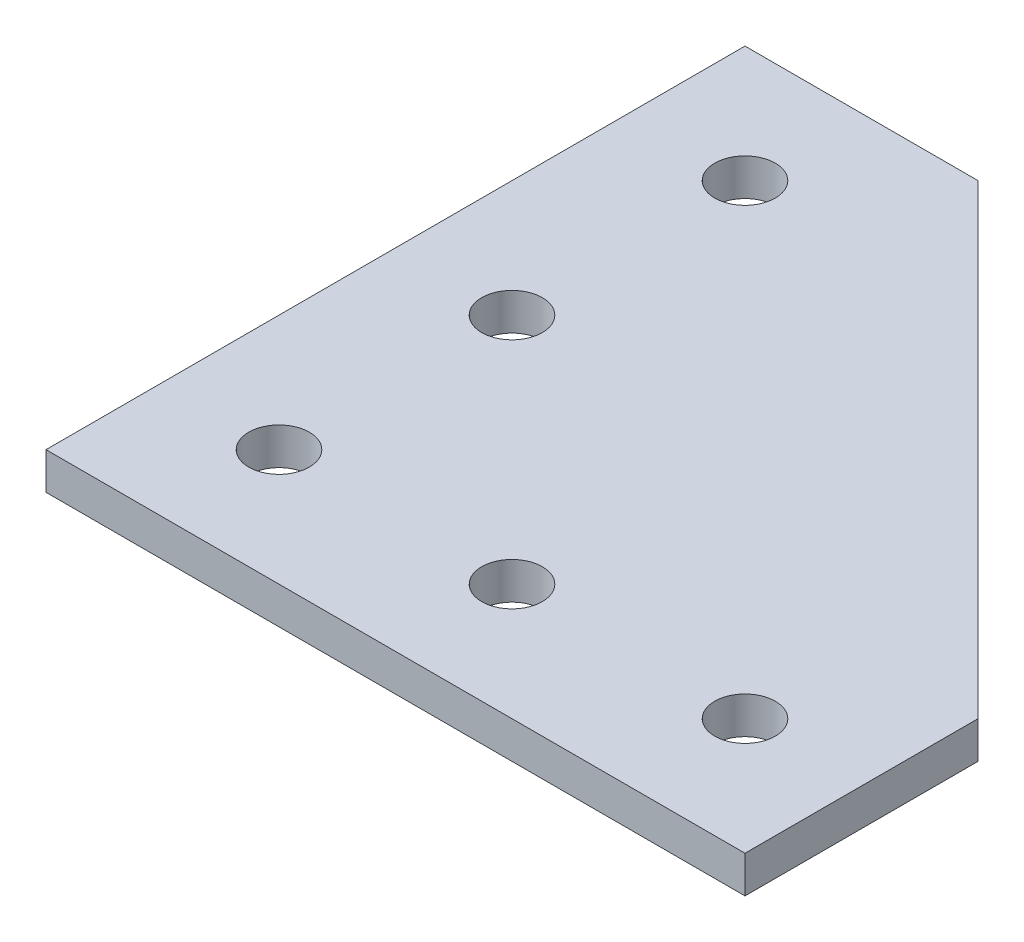
ISO-10303-21;
HEADER;
FILE_DESCRIPTION(('STEP AP214'),'2;1');
FILE_NAME('part.step','',(''),(''),'','','');
FILE_SCHEMA(('AUTOMOTIVE_DESIGN { 1 0 10303 214 1 1 1 1 }'));
ENDSEC;
DATA;
#1=APPLICATION_CONTEXT('core data for automotive mechanical design processes');
#2=APPLICATION_PROTOCOL_DEFINITION('international standard','automotive_design',2000,#1);
#3=PRODUCT_CONTEXT('',#1,'mechanical');
#4=PRODUCT('Part','Part','',(#3));
#5=PRODUCT_RELATED_PRODUCT_CATEGORY('part','',(#4));
#6=PRODUCT_DEFINITION_FORMATION('','',#4);
#7=PRODUCT_DEFINITION_CONTEXT('part definition',#1,'design');
#8=PRODUCT_DEFINITION('design','',#6,#7);
#9=PRODUCT_DEFINITION_SHAPE('','',#8);
#10=(LENGTH_UNIT() NAMED_UNIT(*) SI_UNIT(.MILLI.,.METRE.));
#11=(NAMED_UNIT(*) PLANE_ANGLE_UNIT() SI_UNIT($,.RADIAN.));
#12=(NAMED_UNIT(*) SI_UNIT($,.STERADIAN.) SOLID_ANGLE_UNIT());
#13=UNCERTAINTY_MEASURE_WITH_UNIT(LENGTH_MEASURE(1.E-05),#10,'distance_accuracy_value','');
#14=(GEOMETRIC_REPRESENTATION_CONTEXT(3) GLOBAL_UNCERTAINTY_ASSIGNED_CONTEXT((#13)) GLOBAL_UNIT_ASSIGNED_CONTEXT((#10,
#11,#12)) REPRESENTATION_CONTEXT('',''));
#15=CARTESIAN_POINT('',(0.,0.,0.));
#16=DIRECTION('',(0.,0.,1.));
#17=DIRECTION('',(1.,0.,0.));
#18=AXIS2_PLACEMENT_3D('',#15,#16,#17);
#19=CARTESIAN_POINT('',(0.,3.175,0.));
#20=DIRECTION('',(0.,1.,0.));
#21=DIRECTION('',(0.,0.,1.));
#22=AXIS2_PLACEMENT_3D('',#19,#20,#21);
#23=PLANE('',#22);
#24=CARTESIAN_POINT('',(10.,3.175,-10.));
#25=DIRECTION('',(0.,1.,0.));
#26=DIRECTION('',(0.,0.,1.));
#27=AXIS2_PLACEMENT_3D('',#24,#25,#26);
#28=CIRCLE('',#27,2.59999999999999);
#29=CARTESIAN_POINT('',(10.,3.175,-7.40000000000004));
#30=VERTEX_POINT('',#29);
#31=EDGE_CURVE('E179',#30,#30,#28,.T.);
#32=ORIENTED_EDGE('',*,*,#31,.F.);
#33=EDGE_LOOP('',(#32));
#34=FACE_BOUND('',#33,.T.);
#35=CARTESIAN_POINT('',(10.0000000000002,3.175,-49.9999999999998));
#36=DIRECTION('',(0.,1.,0.));
#37=DIRECTION('',(0.,0.,1.));
#38=AXIS2_PLACEMENT_3D('',#35,#36,#37);
#39=CIRCLE('',#38,2.59999999999998);
#40=CARTESIAN_POINT('',(10.0000000000002,3.175,-47.3999999999998));
#41=VERTEX_POINT('',#40);
#42=EDGE_CURVE('E191',#41,#41,#39,.T.);
#43=ORIENTED_EDGE('',*,*,#42,.F.);
#44=EDGE_LOOP('',(#43));
#45=FACE_BOUND('',#44,.T.);
#46=DIRECTION('',(1.,0.,0.));
#47=VECTOR('',#46,1.);
#48=CARTESIAN_POINT('',(1.80411241501588E-13,3.175,0.));
#49=LINE('',#48,#47);
#50=CARTESIAN_POINT('',(1.80411241501588E-13,3.175,0.));
#51=VERTEX_POINT('',#50);
#52=CARTESIAN_POINT('',(60.,3.175,0.));
#53=VERTEX_POINT('',#52);
#54=EDGE_CURVE('E119',#51,#53,#49,.T.);
#55=ORIENTED_EDGE('',*,*,#54,.T.);
#56=DIRECTION('',(0.,0.,-1.));
#57=VECTOR('',#56,1.);
#58=CARTESIAN_POINT('',(60.,3.175,0.));
#59=LINE('',#58,#57);
#60=CARTESIAN_POINT('',(59.9999999999997,3.175,-20.0000000000005));
#61=VERTEX_POINT('',#60);
#62=EDGE_CURVE('E85',#53,#61,#59,.T.);
#63=ORIENTED_EDGE('',*,*,#62,.T.);
#64=DIRECTION('',(-0.707106781186546,0.,-0.707106781186549));
#65=VECTOR('',#64,1.);
#66=CARTESIAN_POINT('',(59.9999999999997,3.175,-20.0000000000005));
#67=LINE('',#66,#65);
#68=CARTESIAN_POINT('',(20.0000000000006,3.175,-59.9999999999997));
#69=VERTEX_POINT('',#68);
#70=EDGE_CURVE('E89',#61,#69,#67,.T.);
#71=ORIENTED_EDGE('',*,*,#70,.T.);
#72=DIRECTION('',(-1.,0.,0.));
#73=VECTOR('',#72,1.);
#74=CARTESIAN_POINT('',(1.80411241501588E-13,3.175,-59.9999999999997));
#75=LINE('',#74,#73);
#76=CARTESIAN_POINT('',(1.80411241501588E-13,3.175,-59.9999999999997));
#77=VERTEX_POINT('',#76);
#78=EDGE_CURVE('E93',#69,#77,#75,.T.);
#79=ORIENTED_EDGE('',*,*,#78,.T.);
#80=DIRECTION('',(0.,0.,1.));
#81=VECTOR('',#80,1.);
#82=CARTESIAN_POINT('',(1.80411241501588E-13,3.175,0.));
#83=LINE('',#82,#81);
#84=EDGE_CURVE('E51',#77,#51,#83,.T.);
#85=ORIENTED_EDGE('',*,*,#84,.T.);
#86=EDGE_LOOP('',(#55,#63,#71,#79,#85));
#87=FACE_BOUND('',#86,.T.);
#88=CARTESIAN_POINT('',(49.9999999999999,3.175,-9.99999999999983));
#89=DIRECTION('',(0.,1.,0.));
#90=DIRECTION('',(0.,0.,1.));
#91=AXIS2_PLACEMENT_3D('',#88,#89,#90);
#92=CIRCLE('',#91,2.59999999999999);
#93=CARTESIAN_POINT('',(49.9999999999999,3.175,-7.39999999999984));
#94=VERTEX_POINT('',#93);
#95=EDGE_CURVE('E113',#94,#94,#92,.T.);
#96=ORIENTED_EDGE('',*,*,#95,.F.);
#97=EDGE_LOOP('',(#96));
#98=FACE_BOUND('',#97,.T.);
#99=CARTESIAN_POINT('',(30.,3.175,-9.99999999999992));
#100=DIRECTION('',(0.,1.,0.));
#101=DIRECTION('',(0.,0.,1.));
#102=AXIS2_PLACEMENT_3D('',#99,#100,#101);
#103=CIRCLE('',#102,2.59999999999999);
#104=CARTESIAN_POINT('',(30.,3.175,-7.39999999999993));
#105=VERTEX_POINT('',#104);
#106=EDGE_CURVE('E185',#105,#105,#103,.T.);
#107=ORIENTED_EDGE('',*,*,#106,.F.);
#108=EDGE_LOOP('',(#107));
#109=FACE_BOUND('',#108,.T.);
#110=CARTESIAN_POINT('',(10.0000000000003,3.175,-29.9999999999997));
#111=DIRECTION('',(0.,1.,0.));
#112=DIRECTION('',(0.,0.,1.));
#113=AXIS2_PLACEMENT_3D('',#110,#111,#112);
#114=CIRCLE('',#113,2.59999999999999);
#115=CARTESIAN_POINT('',(10.0000000000003,3.175,-27.3999999999997));
#116=VERTEX_POINT('',#115);
#117=EDGE_CURVE('E170',#116,#116,#114,.T.);
#118=ORIENTED_EDGE('',*,*,#117,.F.);
#119=EDGE_LOOP('',(#118));
#120=FACE_BOUND('',#119,.T.);
#121=ADVANCED_FACE('F34',(#34,#45,#87,#98,#109,#120),#23,.T.);
#122=CARTESIAN_POINT('',(0.,0.,0.));
#123=DIRECTION('',(0.,1.,0.));
#124=DIRECTION('',(0.,0.,1.));
#125=AXIS2_PLACEMENT_3D('',#122,#123,#124);
#126=PLANE('',#125);
#127=CARTESIAN_POINT('',(10.,0.,-10.));
#128=DIRECTION('',(0.,1.,0.));
#129=DIRECTION('',(0.,0.,1.));
#130=AXIS2_PLACEMENT_3D('',#127,#128,#129);
#131=CIRCLE('',#130,2.59999999999999);
#132=CARTESIAN_POINT('',(10.,0.,-7.40000000000004));
#133=VERTEX_POINT('',#132);
#134=EDGE_CURVE('E176',#133,#133,#131,.T.);
#135=ORIENTED_EDGE('',*,*,#134,.T.);
#136=EDGE_LOOP('',(#135));
#137=FACE_BOUND('',#136,.T.);
#138=CARTESIAN_POINT('',(10.0000000000002,0.,-49.9999999999998));
#139=DIRECTION('',(0.,1.,0.));
#140=DIRECTION('',(0.,0.,1.));
#141=AXIS2_PLACEMENT_3D('',#138,#139,#140);
#142=CIRCLE('',#141,2.59999999999998);
#143=CARTESIAN_POINT('',(10.0000000000002,0.,-47.3999999999998));
#144=VERTEX_POINT('',#143);
#145=EDGE_CURVE('E188',#144,#144,#142,.T.);
#146=ORIENTED_EDGE('',*,*,#145,.T.);
#147=EDGE_LOOP('',(#146));
#148=FACE_BOUND('',#147,.T.);
#149=DIRECTION('',(1.,0.,0.));
#150=VECTOR('',#149,1.);
#151=CARTESIAN_POINT('',(1.80411241501588E-13,0.,0.));
#152=LINE('',#151,#150);
#153=CARTESIAN_POINT('',(1.80411241501588E-13,0.,0.));
#154=VERTEX_POINT('',#153);
#155=CARTESIAN_POINT('',(60.,0.,0.));
#156=VERTEX_POINT('',#155);
#157=EDGE_CURVE('E109',#154,#156,#152,.T.);
#158=ORIENTED_EDGE('',*,*,#157,.F.);
#159=DIRECTION('',(0.,0.,1.));
#160=VECTOR('',#159,1.);
#161=CARTESIAN_POINT('',(1.80411241501588E-13,0.,0.));
#162=LINE('',#161,#160);
#163=CARTESIAN_POINT('',(1.80411241501588E-13,0.,-59.9999999999997));
#164=VERTEX_POINT('',#163);
#165=EDGE_CURVE('E77',#164,#154,#162,.T.);
#166=ORIENTED_EDGE('',*,*,#165,.F.);
#167=DIRECTION('',(-1.,0.,0.));
#168=VECTOR('',#167,1.);
#169=CARTESIAN_POINT('',(1.80411241501588E-13,0.,-59.9999999999997));
#170=LINE('',#169,#168);
#171=CARTESIAN_POINT('',(20.0000000000006,0.,-59.9999999999997));
#172=VERTEX_POINT('',#171);
#173=EDGE_CURVE('E71',#172,#164,#170,.T.);
#174=ORIENTED_EDGE('',*,*,#173,.F.);
#175=DIRECTION('',(-0.707106781186546,0.,-0.707106781186549));
#176=VECTOR('',#175,1.);
#177=CARTESIAN_POINT('',(59.9999999999997,0.,-20.0000000000005));
#178=LINE('',#177,#176);
#179=CARTESIAN_POINT('',(59.9999999999997,0.,-20.0000000000005));
#180=VERTEX_POINT('',#179);
#181=EDGE_CURVE('E100',#180,#172,#178,.T.);
#182=ORIENTED_EDGE('',*,*,#181,.F.);
#183=DIRECTION('',(0.,0.,-1.));
#184=VECTOR('',#183,1.);
#185=CARTESIAN_POINT('',(60.,0.,0.));
#186=LINE('',#185,#184);
#187=EDGE_CURVE('E112',#156,#180,#186,.T.);
#188=ORIENTED_EDGE('',*,*,#187,.F.);
#189=EDGE_LOOP('',(#158,#166,#174,#182,#188));
#190=FACE_BOUND('',#189,.T.);
#191=CARTESIAN_POINT('',(49.9999999999999,0.,-9.99999999999983));
#192=DIRECTION('',(0.,1.,0.));
#193=DIRECTION('',(0.,0.,1.));
#194=AXIS2_PLACEMENT_3D('',#191,#192,#193);
#195=CIRCLE('',#194,2.59999999999999);
#196=CARTESIAN_POINT('',(49.9999999999999,0.,-7.39999999999984));
#197=VERTEX_POINT('',#196);
#198=EDGE_CURVE('E194',#197,#197,#195,.T.);
#199=ORIENTED_EDGE('',*,*,#198,.T.);
#200=EDGE_LOOP('',(#199));
#201=FACE_BOUND('',#200,.T.);
#202=CARTESIAN_POINT('',(30.,0.,-9.99999999999992));
#203=DIRECTION('',(0.,1.,0.));
#204=DIRECTION('',(0.,0.,1.));
#205=AXIS2_PLACEMENT_3D('',#202,#203,#204);
#206=CIRCLE('',#205,2.59999999999999);
#207=CARTESIAN_POINT('',(30.,0.,-7.39999999999993));
#208=VERTEX_POINT('',#207);
#209=EDGE_CURVE('E182',#208,#208,#206,.T.);
#210=ORIENTED_EDGE('',*,*,#209,.T.);
#211=EDGE_LOOP('',(#210));
#212=FACE_BOUND('',#211,.T.);
#213=CARTESIAN_POINT('',(10.0000000000003,0.,-29.9999999999997));
#214=DIRECTION('',(0.,1.,0.));
#215=DIRECTION('',(0.,0.,1.));
#216=AXIS2_PLACEMENT_3D('',#213,#214,#215);
#217=CIRCLE('',#216,2.59999999999999);
#218=CARTESIAN_POINT('',(10.0000000000003,0.,-27.3999999999997));
#219=VERTEX_POINT('',#218);
#220=EDGE_CURVE('E173',#219,#219,#217,.T.);
#221=ORIENTED_EDGE('',*,*,#220,.T.);
#222=EDGE_LOOP('',(#221));
#223=FACE_BOUND('',#222,.T.);
#224=ADVANCED_FACE('F123',(#137,#148,#190,#201,#212,#223),#126,.F.);
#225=CARTESIAN_POINT('',(1.80411241501588E-13,3.175,0.));
#226=DIRECTION('',(0.,0.,-1.));
#227=DIRECTION('',(-1.,0.,0.));
#228=AXIS2_PLACEMENT_3D('',#225,#226,#227);
#229=PLANE('',#228);
#230=ORIENTED_EDGE('',*,*,#157,.T.);
#231=DIRECTION('',(0.,-1.,0.));
#232=VECTOR('',#231,1.);
#233=CARTESIAN_POINT('',(60.,3.175,0.));
#234=LINE('',#233,#232);
#235=EDGE_CURVE('E11',#53,#156,#234,.T.);
#236=ORIENTED_EDGE('',*,*,#235,.F.);
#237=ORIENTED_EDGE('',*,*,#54,.F.);
#238=DIRECTION('',(0.,-1.,0.));
#239=VECTOR('',#238,1.);
#240=CARTESIAN_POINT('',(1.80411241501588E-13,3.175,0.));
#241=LINE('',#240,#239);
#242=EDGE_CURVE('E105',#51,#154,#241,.T.);
#243=ORIENTED_EDGE('',*,*,#242,.T.);
#244=EDGE_LOOP('',(#230,#236,#237,#243));
#245=FACE_BOUND('',#244,.T.);
#246=ADVANCED_FACE('F36',(#245),#229,.F.);
#247=CARTESIAN_POINT('',(60.,3.175,0.));
#248=DIRECTION('',(-1.,0.,0.));
#249=DIRECTION('',(0.,0.,1.));
#250=AXIS2_PLACEMENT_3D('',#247,#248,#249);
#251=PLANE('',#250);
#252=ORIENTED_EDGE('',*,*,#187,.T.);
#253=DIRECTION('',(0.,-1.,0.));
#254=VECTOR('',#253,1.);
#255=CARTESIAN_POINT('',(59.9999999999997,3.175,-20.0000000000005));
#256=LINE('',#255,#254);
#257=EDGE_CURVE('E43',#61,#180,#256,.T.);
#258=ORIENTED_EDGE('',*,*,#257,.F.);
#259=ORIENTED_EDGE('',*,*,#62,.F.);
#260=ORIENTED_EDGE('',*,*,#235,.T.);
#261=EDGE_LOOP('',(#252,#258,#259,#260));
#262=FACE_BOUND('',#261,.T.);
#263=ADVANCED_FACE('F254',(#262),#251,.F.);
#264=CARTESIAN_POINT('',(59.9999999999997,3.175,-20.0000000000005));
#265=DIRECTION('',(-0.707106781186549,0.,0.707106781186546));
#266=DIRECTION('',(0.707106781186546,0.,0.707106781186549));
#267=AXIS2_PLACEMENT_3D('',#264,#265,#266);
#268=PLANE('',#267);
#269=ORIENTED_EDGE('',*,*,#181,.T.);
#270=DIRECTION('',(0.,-1.,0.));
#271=VECTOR('',#270,1.);
#272=CARTESIAN_POINT('',(20.0000000000006,3.175,-59.9999999999997));
#273=LINE('',#272,#271);
#274=EDGE_CURVE('E97',#69,#172,#273,.T.);
#275=ORIENTED_EDGE('',*,*,#274,.F.);
#276=ORIENTED_EDGE('',*,*,#70,.F.);
#277=ORIENTED_EDGE('',*,*,#257,.T.);
#278=EDGE_LOOP('',(#269,#275,#276,#277));
#279=FACE_BOUND('',#278,.T.);
#280=ADVANCED_FACE('F98',(#279),#268,.F.);
#281=CARTESIAN_POINT('',(1.80411241501588E-13,3.175,-59.9999999999997));
#282=DIRECTION('',(0.,0.,1.));
#283=DIRECTION('',(1.,0.,0.));
#284=AXIS2_PLACEMENT_3D('',#281,#282,#283);
#285=PLANE('',#284);
#286=ORIENTED_EDGE('',*,*,#173,.T.);
#287=DIRECTION('',(0.,-1.,0.));
#288=VECTOR('',#287,1.);
#289=CARTESIAN_POINT('',(1.80411241501588E-13,3.175,-59.9999999999997));
#290=LINE('',#289,#288);
#291=EDGE_CURVE('E101',#77,#164,#290,.T.);
#292=ORIENTED_EDGE('',*,*,#291,.F.);
#293=ORIENTED_EDGE('',*,*,#78,.F.);
#294=ORIENTED_EDGE('',*,*,#274,.T.);
#295=EDGE_LOOP('',(#286,#292,#293,#294));
#296=FACE_BOUND('',#295,.T.);
#297=ADVANCED_FACE('F103',(#296),#285,.F.);
#298=CARTESIAN_POINT('',(1.80411241501588E-13,3.175,0.));
#299=DIRECTION('',(1.,0.,0.));
#300=DIRECTION('',(0.,0.,-1.));
#301=AXIS2_PLACEMENT_3D('',#298,#299,#300);
#302=PLANE('',#301);
#303=ORIENTED_EDGE('',*,*,#165,.T.);
#304=ORIENTED_EDGE('',*,*,#242,.F.);
#305=ORIENTED_EDGE('',*,*,#84,.F.);
#306=ORIENTED_EDGE('',*,*,#291,.T.);
#307=EDGE_LOOP('',(#303,#304,#305,#306));
#308=FACE_BOUND('',#307,.T.);
#309=ADVANCED_FACE('F128',(#308),#302,.F.);
#310=CARTESIAN_POINT('',(49.9999999999999,3.175,-9.99999999999983));
#311=DIRECTION('',(0.,-1.,0.));
#312=DIRECTION('',(0.,0.,-1.));
#313=AXIS2_PLACEMENT_3D('',#310,#311,#312);
#314=CYLINDRICAL_SURFACE('',#313,2.59999999999999);
#315=ORIENTED_EDGE('',*,*,#95,.T.);
#316=EDGE_LOOP('',(#315));
#317=FACE_BOUND('',#316,.T.);
#318=ORIENTED_EDGE('',*,*,#198,.F.);
#319=EDGE_LOOP('',(#318));
#320=FACE_BOUND('',#319,.T.);
#321=ADVANCED_FACE('F130',(#317,#320),#314,.F.);
#322=CARTESIAN_POINT('',(10.0000000000002,3.175,-49.9999999999998));
#323=DIRECTION('',(0.,-1.,0.));
#324=DIRECTION('',(0.,0.,-1.));
#325=AXIS2_PLACEMENT_3D('',#322,#323,#324);
#326=CYLINDRICAL_SURFACE('',#325,2.59999999999998);
#327=ORIENTED_EDGE('',*,*,#42,.T.);
#328=EDGE_LOOP('',(#327));
#329=FACE_BOUND('',#328,.T.);
#330=ORIENTED_EDGE('',*,*,#145,.F.);
#331=EDGE_LOOP('',(#330));
#332=FACE_BOUND('',#331,.T.);
#333=ADVANCED_FACE('F136',(#329,#332),#326,.F.);
#334=CARTESIAN_POINT('',(30.,3.175,-9.99999999999992));
#335=DIRECTION('',(0.,-1.,0.));
#336=DIRECTION('',(0.,0.,-1.));
#337=AXIS2_PLACEMENT_3D('',#334,#335,#336);
#338=CYLINDRICAL_SURFACE('',#337,2.59999999999999);
#339=ORIENTED_EDGE('',*,*,#106,.T.);
#340=EDGE_LOOP('',(#339));
#341=FACE_BOUND('',#340,.T.);
#342=ORIENTED_EDGE('',*,*,#209,.F.);
#343=EDGE_LOOP('',(#342));
#344=FACE_BOUND('',#343,.T.);
#345=ADVANCED_FACE('F153',(#341,#344),#338,.F.);
#346=CARTESIAN_POINT('',(10.,3.175,-10.));
#347=DIRECTION('',(0.,-1.,0.));
#348=DIRECTION('',(0.,0.,-1.));
#349=AXIS2_PLACEMENT_3D('',#346,#347,#348);
#350=CYLINDRICAL_SURFACE('',#349,2.59999999999999);
#351=ORIENTED_EDGE('',*,*,#31,.T.);
#352=EDGE_LOOP('',(#351));
#353=FACE_BOUND('',#352,.T.);
#354=ORIENTED_EDGE('',*,*,#134,.F.);
#355=EDGE_LOOP('',(#354));
#356=FACE_BOUND('',#355,.T.);
#357=ADVANCED_FACE('F157',(#353,#356),#350,.F.);
#358=CARTESIAN_POINT('',(10.0000000000003,3.175,-29.9999999999997));
#359=DIRECTION('',(0.,-1.,0.));
#360=DIRECTION('',(0.,0.,-1.));
#361=AXIS2_PLACEMENT_3D('',#358,#359,#360);
#362=CYLINDRICAL_SURFACE('',#361,2.59999999999999);
#363=ORIENTED_EDGE('',*,*,#117,.T.);
#364=EDGE_LOOP('',(#363));
#365=FACE_BOUND('',#364,.T.);
#366=ORIENTED_EDGE('',*,*,#220,.F.);
#367=EDGE_LOOP('',(#366));
#368=FACE_BOUND('',#367,.T.);
#369=ADVANCED_FACE('F161',(#365,#368),#362,.F.);
#370=CLOSED_SHELL('',(#121,#224,#246,#263,#280,#297,#309,#321,#333,#345,#357,#369));
#371=MANIFOLD_SOLID_BREP('B2',#370);
#372=ADVANCED_BREP_SHAPE_REPRESENTATION('',(#18,#371),#14);
#373=SHAPE_DEFINITION_REPRESENTATION(#9,#372);
ENDSEC;
END-ISO-10303-21;
